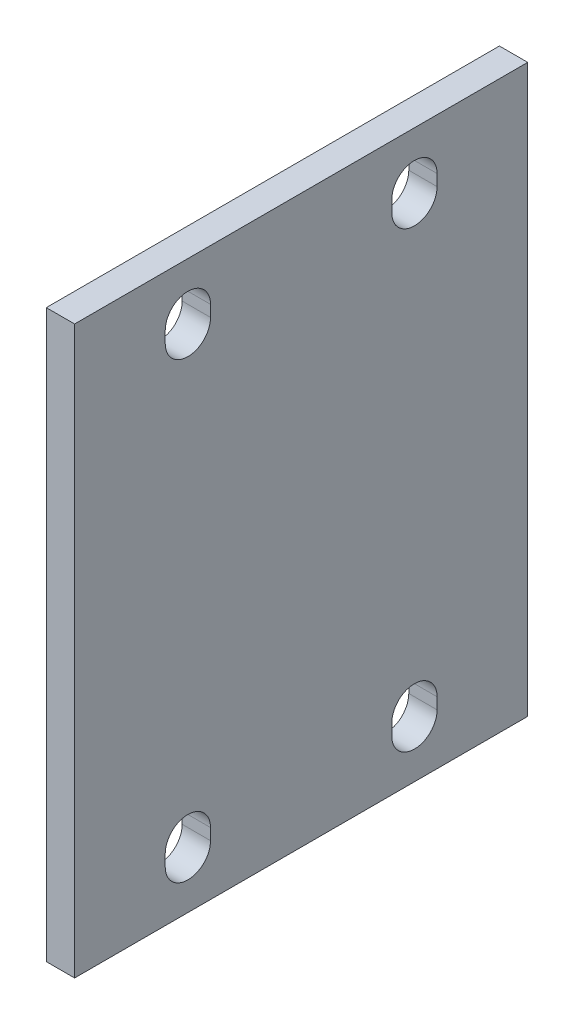
ISO-10303-21;
HEADER;
FILE_DESCRIPTION(('STEP AP214'),'2;1');
FILE_NAME('part.step','',(''),(''),'','','');
FILE_SCHEMA(('AUTOMOTIVE_DESIGN { 1 0 10303 214 1 1 1 1 }'));
ENDSEC;
DATA;
#1=APPLICATION_CONTEXT('core data for automotive mechanical design processes');
#2=APPLICATION_PROTOCOL_DEFINITION('international standard','automotive_design',2000,#1);
#3=PRODUCT_CONTEXT('',#1,'mechanical');
#4=PRODUCT('Part','Part','',(#3));
#5=PRODUCT_RELATED_PRODUCT_CATEGORY('part','',(#4));
#6=PRODUCT_DEFINITION_FORMATION('','',#4);
#7=PRODUCT_DEFINITION_CONTEXT('part definition',#1,'design');
#8=PRODUCT_DEFINITION('design','',#6,#7);
#9=PRODUCT_DEFINITION_SHAPE('','',#8);
#10=(LENGTH_UNIT() NAMED_UNIT(*) SI_UNIT(.MILLI.,.METRE.));
#11=(NAMED_UNIT(*) PLANE_ANGLE_UNIT() SI_UNIT($,.RADIAN.));
#12=(NAMED_UNIT(*) SI_UNIT($,.STERADIAN.) SOLID_ANGLE_UNIT());
#13=UNCERTAINTY_MEASURE_WITH_UNIT(LENGTH_MEASURE(1.E-05),#10,'distance_accuracy_value','');
#14=(GEOMETRIC_REPRESENTATION_CONTEXT(3) GLOBAL_UNCERTAINTY_ASSIGNED_CONTEXT((#13)) GLOBAL_UNIT_ASSIGNED_CONTEXT((#10,
#11,#12)) REPRESENTATION_CONTEXT('',''));
#15=CARTESIAN_POINT('',(0.,0.,0.));
#16=DIRECTION('',(0.,0.,1.));
#17=DIRECTION('',(1.,0.,0.));
#18=AXIS2_PLACEMENT_3D('',#15,#16,#17);
#19=CARTESIAN_POINT('',(5.,0.,24.));
#20=DIRECTION('',(0.,0.,1.));
#21=DIRECTION('',(1.,0.,0.));
#22=AXIS2_PLACEMENT_3D('',#19,#20,#21);
#23=PLANE('',#22);
#24=DIRECTION('',(0.,1.,0.));
#25=VECTOR('',#24,1.);
#26=CARTESIAN_POINT('',(0.,0.,24.));
#27=LINE('',#26,#25);
#28=CARTESIAN_POINT('',(0.,-41.,24.));
#29=VERTEX_POINT('',#28);
#30=CARTESIAN_POINT('',(0.,-39.,24.));
#31=VERTEX_POINT('',#30);
#32=EDGE_CURVE('E267',#29,#31,#27,.T.);
#33=ORIENTED_EDGE('',*,*,#32,.T.);
#34=DIRECTION('',(-1.,0.,0.));
#35=VECTOR('',#34,1.);
#36=CARTESIAN_POINT('',(5.,-39.,24.));
#37=LINE('',#36,#35);
#38=CARTESIAN_POINT('',(5.,-39.,24.));
#39=VERTEX_POINT('',#38);
#40=EDGE_CURVE('E11',#39,#31,#37,.T.);
#41=ORIENTED_EDGE('',*,*,#40,.F.);
#42=DIRECTION('',(0.,1.,0.));
#43=VECTOR('',#42,1.);
#44=CARTESIAN_POINT('',(5.,0.,24.));
#45=LINE('',#44,#43);
#46=CARTESIAN_POINT('',(5.,-41.,24.));
#47=VERTEX_POINT('',#46);
#48=EDGE_CURVE('E186',#47,#39,#45,.T.);
#49=ORIENTED_EDGE('',*,*,#48,.F.);
#50=DIRECTION('',(-1.,0.,0.));
#51=VECTOR('',#50,1.);
#52=CARTESIAN_POINT('',(5.,-41.,24.));
#53=LINE('',#52,#51);
#54=EDGE_CURVE('E279',#47,#29,#53,.T.);
#55=ORIENTED_EDGE('',*,*,#54,.T.);
#56=EDGE_LOOP('',(#33,#41,#49,#55));
#57=FACE_BOUND('',#56,.T.);
#58=ADVANCED_FACE('F41',(#57),#23,.F.);
#59=CARTESIAN_POINT('',(5.,-39.,20.));
#60=DIRECTION('',(-1.,0.,0.));
#61=DIRECTION('',(0.,0.,1.));
#62=AXIS2_PLACEMENT_3D('',#59,#60,#61);
#63=CYLINDRICAL_SURFACE('',#62,3.99999999999999);
#64=CARTESIAN_POINT('',(0.,-39.,20.));
#65=DIRECTION('',(1.,0.,0.));
#66=DIRECTION('',(0.,0.,-1.));
#67=AXIS2_PLACEMENT_3D('',#64,#65,#66);
#68=CIRCLE('',#67,3.99999999999999);
#69=CARTESIAN_POINT('',(0.,-39.,16.));
#70=VERTEX_POINT('',#69);
#71=EDGE_CURVE('E193',#31,#70,#68,.F.);
#72=ORIENTED_EDGE('',*,*,#71,.T.);
#73=DIRECTION('',(-1.,0.,0.));
#74=VECTOR('',#73,1.);
#75=CARTESIAN_POINT('',(5.,-39.,16.));
#76=LINE('',#75,#74);
#77=CARTESIAN_POINT('',(5.,-39.,16.));
#78=VERTEX_POINT('',#77);
#79=EDGE_CURVE('E52',#78,#70,#76,.T.);
#80=ORIENTED_EDGE('',*,*,#79,.F.);
#81=CARTESIAN_POINT('',(5.,-39.,20.));
#82=DIRECTION('',(1.,0.,0.));
#83=DIRECTION('',(0.,0.,-1.));
#84=AXIS2_PLACEMENT_3D('',#81,#82,#83);
#85=CIRCLE('',#84,3.99999999999999);
#86=EDGE_CURVE('E180',#39,#78,#85,.F.);
#87=ORIENTED_EDGE('',*,*,#86,.F.);
#88=ORIENTED_EDGE('',*,*,#40,.T.);
#89=EDGE_LOOP('',(#72,#80,#87,#88));
#90=FACE_BOUND('',#89,.T.);
#91=ADVANCED_FACE('F192',(#90),#63,.F.);
#92=CARTESIAN_POINT('',(5.,0.,16.));
#93=DIRECTION('',(0.,0.,1.));
#94=DIRECTION('',(1.,0.,0.));
#95=AXIS2_PLACEMENT_3D('',#92,#93,#94);
#96=PLANE('',#95);
#97=DIRECTION('',(0.,1.,0.));
#98=VECTOR('',#97,1.);
#99=CARTESIAN_POINT('',(0.,0.,16.));
#100=LINE('',#99,#98);
#101=CARTESIAN_POINT('',(0.,-41.,16.));
#102=VERTEX_POINT('',#101);
#103=EDGE_CURVE('E273',#102,#70,#100,.T.);
#104=ORIENTED_EDGE('',*,*,#103,.F.);
#105=DIRECTION('',(-1.,0.,0.));
#106=VECTOR('',#105,1.);
#107=CARTESIAN_POINT('',(5.,-41.,16.));
#108=LINE('',#107,#106);
#109=CARTESIAN_POINT('',(5.,-41.,16.));
#110=VERTEX_POINT('',#109);
#111=EDGE_CURVE('E123',#110,#102,#108,.T.);
#112=ORIENTED_EDGE('',*,*,#111,.F.);
#113=DIRECTION('',(0.,1.,0.));
#114=VECTOR('',#113,1.);
#115=CARTESIAN_POINT('',(5.,0.,16.));
#116=LINE('',#115,#114);
#117=EDGE_CURVE('E184',#110,#78,#116,.T.);
#118=ORIENTED_EDGE('',*,*,#117,.T.);
#119=ORIENTED_EDGE('',*,*,#79,.T.);
#120=EDGE_LOOP('',(#104,#112,#118,#119));
#121=FACE_BOUND('',#120,.T.);
#122=ADVANCED_FACE('F199',(#121),#96,.T.);
#123=CARTESIAN_POINT('',(5.,0.,-24.));
#124=DIRECTION('',(0.,0.,-1.));
#125=DIRECTION('',(-1.,0.,0.));
#126=AXIS2_PLACEMENT_3D('',#123,#124,#125);
#127=PLANE('',#126);
#128=DIRECTION('',(0.,-1.,0.));
#129=VECTOR('',#128,1.);
#130=CARTESIAN_POINT('',(0.,0.,-24.));
#131=LINE('',#130,#129);
#132=CARTESIAN_POINT('',(0.,41.,-24.));
#133=VERTEX_POINT('',#132);
#134=CARTESIAN_POINT('',(0.,39.,-24.));
#135=VERTEX_POINT('',#134);
#136=EDGE_CURVE('E252',#133,#135,#131,.T.);
#137=ORIENTED_EDGE('',*,*,#136,.T.);
#138=DIRECTION('',(-1.,0.,0.));
#139=VECTOR('',#138,1.);
#140=CARTESIAN_POINT('',(5.,39.,-24.));
#141=LINE('',#140,#139);
#142=CARTESIAN_POINT('',(5.,39.,-24.));
#143=VERTEX_POINT('',#142);
#144=EDGE_CURVE('E282',#143,#135,#141,.T.);
#145=ORIENTED_EDGE('',*,*,#144,.F.);
#146=DIRECTION('',(0.,-1.,0.));
#147=VECTOR('',#146,1.);
#148=CARTESIAN_POINT('',(5.,0.,-24.));
#149=LINE('',#148,#147);
#150=CARTESIAN_POINT('',(5.,41.,-24.));
#151=VERTEX_POINT('',#150);
#152=EDGE_CURVE('E388',#151,#143,#149,.T.);
#153=ORIENTED_EDGE('',*,*,#152,.F.);
#154=DIRECTION('',(-1.,0.,0.));
#155=VECTOR('',#154,1.);
#156=CARTESIAN_POINT('',(5.,41.,-24.));
#157=LINE('',#156,#155);
#158=EDGE_CURVE('E285',#151,#133,#157,.T.);
#159=ORIENTED_EDGE('',*,*,#158,.T.);
#160=EDGE_LOOP('',(#137,#145,#153,#159));
#161=FACE_BOUND('',#160,.T.);
#162=ADVANCED_FACE('F413',(#161),#127,.F.);
#163=CARTESIAN_POINT('',(5.,39.,-20.));
#164=DIRECTION('',(-1.,0.,0.));
#165=DIRECTION('',(0.,0.,1.));
#166=AXIS2_PLACEMENT_3D('',#163,#164,#165);
#167=CYLINDRICAL_SURFACE('',#166,3.99999999999998);
#168=CARTESIAN_POINT('',(0.,39.,-20.));
#169=DIRECTION('',(1.,0.,0.));
#170=DIRECTION('',(0.,0.,-1.));
#171=AXIS2_PLACEMENT_3D('',#168,#169,#170);
#172=CIRCLE('',#171,3.99999999999998);
#173=CARTESIAN_POINT('',(0.,39.,-16.));
#174=VERTEX_POINT('',#173);
#175=EDGE_CURVE('E256',#135,#174,#172,.F.);
#176=ORIENTED_EDGE('',*,*,#175,.T.);
#177=DIRECTION('',(-1.,0.,0.));
#178=VECTOR('',#177,1.);
#179=CARTESIAN_POINT('',(5.,39.,-16.));
#180=LINE('',#179,#178);
#181=CARTESIAN_POINT('',(5.,39.,-16.));
#182=VERTEX_POINT('',#181);
#183=EDGE_CURVE('E293',#182,#174,#180,.T.);
#184=ORIENTED_EDGE('',*,*,#183,.F.);
#185=CARTESIAN_POINT('',(5.,39.,-20.));
#186=DIRECTION('',(1.,0.,0.));
#187=DIRECTION('',(0.,0.,-1.));
#188=AXIS2_PLACEMENT_3D('',#185,#186,#187);
#189=CIRCLE('',#188,3.99999999999998);
#190=EDGE_CURVE('E392',#143,#182,#189,.F.);
#191=ORIENTED_EDGE('',*,*,#190,.F.);
#192=ORIENTED_EDGE('',*,*,#144,.T.);
#193=EDGE_LOOP('',(#176,#184,#191,#192));
#194=FACE_BOUND('',#193,.T.);
#195=ADVANCED_FACE('F415',(#194),#167,.F.);
#196=CARTESIAN_POINT('',(5.,0.,-16.));
#197=DIRECTION('',(0.,0.,-1.));
#198=DIRECTION('',(-1.,0.,0.));
#199=AXIS2_PLACEMENT_3D('',#196,#197,#198);
#200=PLANE('',#199);
#201=DIRECTION('',(0.,-1.,0.));
#202=VECTOR('',#201,1.);
#203=CARTESIAN_POINT('',(0.,0.,-16.));
#204=LINE('',#203,#202);
#205=CARTESIAN_POINT('',(0.,41.,-16.));
#206=VERTEX_POINT('',#205);
#207=EDGE_CURVE('E260',#206,#174,#204,.T.);
#208=ORIENTED_EDGE('',*,*,#207,.F.);
#209=DIRECTION('',(-1.,0.,0.));
#210=VECTOR('',#209,1.);
#211=CARTESIAN_POINT('',(5.,41.,-16.));
#212=LINE('',#211,#210);
#213=CARTESIAN_POINT('',(5.,41.,-16.));
#214=VERTEX_POINT('',#213);
#215=EDGE_CURVE('E289',#214,#206,#212,.T.);
#216=ORIENTED_EDGE('',*,*,#215,.F.);
#217=DIRECTION('',(0.,-1.,0.));
#218=VECTOR('',#217,1.);
#219=CARTESIAN_POINT('',(5.,0.,-16.));
#220=LINE('',#219,#218);
#221=EDGE_CURVE('E395',#214,#182,#220,.T.);
#222=ORIENTED_EDGE('',*,*,#221,.T.);
#223=ORIENTED_EDGE('',*,*,#183,.T.);
#224=EDGE_LOOP('',(#208,#216,#222,#223));
#225=FACE_BOUND('',#224,.T.);
#226=ADVANCED_FACE('F419',(#225),#200,.T.);
#227=CARTESIAN_POINT('',(5.,0.,-40.));
#228=DIRECTION('',(0.,0.,-1.));
#229=DIRECTION('',(-1.,0.,0.));
#230=AXIS2_PLACEMENT_3D('',#227,#228,#229);
#231=PLANE('',#230);
#232=DIRECTION('',(0.,-1.,0.));
#233=VECTOR('',#232,1.);
#234=CARTESIAN_POINT('',(0.,0.,-40.));
#235=LINE('',#234,#233);
#236=CARTESIAN_POINT('',(0.,50.,-40.));
#237=VERTEX_POINT('',#236);
#238=CARTESIAN_POINT('',(0.,-50.,-40.));
#239=VERTEX_POINT('',#238);
#240=EDGE_CURVE('E240',#237,#239,#235,.T.);
#241=ORIENTED_EDGE('',*,*,#240,.F.);
#242=DIRECTION('',(-1.,0.,0.));
#243=VECTOR('',#242,1.);
#244=CARTESIAN_POINT('',(5.,50.,-40.));
#245=LINE('',#244,#243);
#246=CARTESIAN_POINT('',(5.,50.,-40.));
#247=VERTEX_POINT('',#246);
#248=EDGE_CURVE('E290',#247,#237,#245,.T.);
#249=ORIENTED_EDGE('',*,*,#248,.F.);
#250=DIRECTION('',(0.,-1.,0.));
#251=VECTOR('',#250,1.);
#252=CARTESIAN_POINT('',(5.,0.,-40.));
#253=LINE('',#252,#251);
#254=CARTESIAN_POINT('',(5.,-50.,-40.));
#255=VERTEX_POINT('',#254);
#256=EDGE_CURVE('E376',#247,#255,#253,.T.);
#257=ORIENTED_EDGE('',*,*,#256,.T.);
#258=DIRECTION('',(-1.,0.,0.));
#259=VECTOR('',#258,1.);
#260=CARTESIAN_POINT('',(5.,-50.,-40.));
#261=LINE('',#260,#259);
#262=EDGE_CURVE('E299',#255,#239,#261,.T.);
#263=ORIENTED_EDGE('',*,*,#262,.T.);
#264=EDGE_LOOP('',(#241,#249,#257,#263));
#265=FACE_BOUND('',#264,.T.);
#266=ADVANCED_FACE('F447',(#265),#231,.T.);
#267=CARTESIAN_POINT('',(5.,50.,0.));
#268=DIRECTION('',(0.,1.,0.));
#269=DIRECTION('',(0.,0.,1.));
#270=AXIS2_PLACEMENT_3D('',#267,#268,#269);
#271=PLANE('',#270);
#272=DIRECTION('',(0.,0.,-1.));
#273=VECTOR('',#272,1.);
#274=CARTESIAN_POINT('',(0.,50.,0.));
#275=LINE('',#274,#273);
#276=CARTESIAN_POINT('',(0.,50.,40.));
#277=VERTEX_POINT('',#276);
#278=EDGE_CURVE('E244',#277,#237,#275,.T.);
#279=ORIENTED_EDGE('',*,*,#278,.F.);
#280=DIRECTION('',(-1.,0.,0.));
#281=VECTOR('',#280,1.);
#282=CARTESIAN_POINT('',(5.,50.,40.));
#283=LINE('',#282,#281);
#284=CARTESIAN_POINT('',(5.,50.,40.));
#285=VERTEX_POINT('',#284);
#286=EDGE_CURVE('E307',#285,#277,#283,.T.);
#287=ORIENTED_EDGE('',*,*,#286,.F.);
#288=DIRECTION('',(0.,0.,-1.));
#289=VECTOR('',#288,1.);
#290=CARTESIAN_POINT('',(5.,50.,0.));
#291=LINE('',#290,#289);
#292=EDGE_CURVE('E380',#285,#247,#291,.T.);
#293=ORIENTED_EDGE('',*,*,#292,.T.);
#294=ORIENTED_EDGE('',*,*,#248,.T.);
#295=EDGE_LOOP('',(#279,#287,#293,#294));
#296=FACE_BOUND('',#295,.T.);
#297=ADVANCED_FACE('F456',(#296),#271,.T.);
#298=CARTESIAN_POINT('',(5.,0.,40.));
#299=DIRECTION('',(0.,0.,-1.));
#300=DIRECTION('',(-1.,0.,0.));
#301=AXIS2_PLACEMENT_3D('',#298,#299,#300);
#302=PLANE('',#301);
#303=DIRECTION('',(0.,-1.,0.));
#304=VECTOR('',#303,1.);
#305=CARTESIAN_POINT('',(0.,0.,40.));
#306=LINE('',#305,#304);
#307=CARTESIAN_POINT('',(0.,-50.,40.));
#308=VERTEX_POINT('',#307);
#309=EDGE_CURVE('E248',#277,#308,#306,.T.);
#310=ORIENTED_EDGE('',*,*,#309,.T.);
#311=DIRECTION('',(-1.,0.,0.));
#312=VECTOR('',#311,1.);
#313=CARTESIAN_POINT('',(5.,-50.,40.));
#314=LINE('',#313,#312);
#315=CARTESIAN_POINT('',(5.,-50.,40.));
#316=VERTEX_POINT('',#315);
#317=EDGE_CURVE('E303',#316,#308,#314,.T.);
#318=ORIENTED_EDGE('',*,*,#317,.F.);
#319=DIRECTION('',(0.,-1.,0.));
#320=VECTOR('',#319,1.);
#321=CARTESIAN_POINT('',(5.,0.,40.));
#322=LINE('',#321,#320);
#323=EDGE_CURVE('E384',#285,#316,#322,.T.);
#324=ORIENTED_EDGE('',*,*,#323,.F.);
#325=ORIENTED_EDGE('',*,*,#286,.T.);
#326=EDGE_LOOP('',(#310,#318,#324,#325));
#327=FACE_BOUND('',#326,.T.);
#328=ADVANCED_FACE('F452',(#327),#302,.F.);
#329=CARTESIAN_POINT('',(5.,39.,20.));
#330=DIRECTION('',(-1.,0.,0.));
#331=DIRECTION('',(0.,0.,1.));
#332=AXIS2_PLACEMENT_3D('',#329,#330,#331);
#333=CYLINDRICAL_SURFACE('',#332,3.99999999999998);
#334=CARTESIAN_POINT('',(0.,39.,20.));
#335=DIRECTION('',(1.,0.,0.));
#336=DIRECTION('',(0.,0.,-1.));
#337=AXIS2_PLACEMENT_3D('',#334,#335,#336);
#338=CIRCLE('',#337,3.99999999999998);
#339=CARTESIAN_POINT('',(0.,39.,24.));
#340=VERTEX_POINT('',#339);
#341=CARTESIAN_POINT('',(0.,39.,16.));
#342=VERTEX_POINT('',#341);
#343=EDGE_CURVE('E224',#340,#342,#338,.T.);
#344=ORIENTED_EDGE('',*,*,#343,.F.);
#345=DIRECTION('',(-1.,0.,0.));
#346=VECTOR('',#345,1.);
#347=CARTESIAN_POINT('',(5.,39.,24.));
#348=LINE('',#347,#346);
#349=CARTESIAN_POINT('',(5.,39.,24.));
#350=VERTEX_POINT('',#349);
#351=EDGE_CURVE('E304',#350,#340,#348,.T.);
#352=ORIENTED_EDGE('',*,*,#351,.F.);
#353=CARTESIAN_POINT('',(5.,39.,20.));
#354=DIRECTION('',(1.,0.,0.));
#355=DIRECTION('',(0.,0.,-1.));
#356=AXIS2_PLACEMENT_3D('',#353,#354,#355);
#357=CIRCLE('',#356,3.99999999999998);
#358=CARTESIAN_POINT('',(5.,39.,16.));
#359=VERTEX_POINT('',#358);
#360=EDGE_CURVE('E353',#350,#359,#357,.T.);
#361=ORIENTED_EDGE('',*,*,#360,.T.);
#362=DIRECTION('',(-1.,0.,0.));
#363=VECTOR('',#362,1.);
#364=CARTESIAN_POINT('',(5.,39.,16.));
#365=LINE('',#364,#363);
#366=EDGE_CURVE('E312',#359,#342,#365,.T.);
#367=ORIENTED_EDGE('',*,*,#366,.T.);
#368=EDGE_LOOP('',(#344,#352,#361,#367));
#369=FACE_BOUND('',#368,.T.);
#370=ADVANCED_FACE('F455',(#369),#333,.F.);
#371=CARTESIAN_POINT('',(5.,0.,24.));
#372=DIRECTION('',(0.,0.,-1.));
#373=DIRECTION('',(-1.,0.,0.));
#374=AXIS2_PLACEMENT_3D('',#371,#372,#373);
#375=PLANE('',#374);
#376=DIRECTION('',(0.,-1.,0.));
#377=VECTOR('',#376,1.);
#378=CARTESIAN_POINT('',(0.,0.,24.));
#379=LINE('',#378,#377);
#380=CARTESIAN_POINT('',(0.,41.,24.));
#381=VERTEX_POINT('',#380);
#382=EDGE_CURVE('E228',#381,#340,#379,.T.);
#383=ORIENTED_EDGE('',*,*,#382,.F.);
#384=DIRECTION('',(-1.,0.,0.));
#385=VECTOR('',#384,1.);
#386=CARTESIAN_POINT('',(5.,41.,24.));
#387=LINE('',#386,#385);
#388=CARTESIAN_POINT('',(5.,41.,24.));
#389=VERTEX_POINT('',#388);
#390=EDGE_CURVE('E318',#389,#381,#387,.T.);
#391=ORIENTED_EDGE('',*,*,#390,.F.);
#392=DIRECTION('',(0.,-1.,0.));
#393=VECTOR('',#392,1.);
#394=CARTESIAN_POINT('',(5.,0.,24.));
#395=LINE('',#394,#393);
#396=EDGE_CURVE('E365',#389,#350,#395,.T.);
#397=ORIENTED_EDGE('',*,*,#396,.T.);
#398=ORIENTED_EDGE('',*,*,#351,.T.);
#399=EDGE_LOOP('',(#383,#391,#397,#398));
#400=FACE_BOUND('',#399,.T.);
#401=ADVANCED_FACE('F470',(#400),#375,.T.);
#402=CARTESIAN_POINT('',(5.,41.,20.));
#403=DIRECTION('',(-1.,0.,0.));
#404=DIRECTION('',(0.,0.,1.));
#405=AXIS2_PLACEMENT_3D('',#402,#403,#404);
#406=CYLINDRICAL_SURFACE('',#405,3.99999999999998);
#407=CARTESIAN_POINT('',(0.,41.,20.));
#408=DIRECTION('',(1.,0.,0.));
#409=DIRECTION('',(0.,0.,-1.));
#410=AXIS2_PLACEMENT_3D('',#407,#408,#409);
#411=CIRCLE('',#410,3.99999999999998);
#412=CARTESIAN_POINT('',(0.,41.,16.));
#413=VERTEX_POINT('',#412);
#414=EDGE_CURVE('E232',#413,#381,#411,.T.);
#415=ORIENTED_EDGE('',*,*,#414,.F.);
#416=DIRECTION('',(-1.,0.,0.));
#417=VECTOR('',#416,1.);
#418=CARTESIAN_POINT('',(5.,41.,16.));
#419=LINE('',#418,#417);
#420=CARTESIAN_POINT('',(5.,41.,16.));
#421=VERTEX_POINT('',#420);
#422=EDGE_CURVE('E315',#421,#413,#419,.T.);
#423=ORIENTED_EDGE('',*,*,#422,.F.);
#424=CARTESIAN_POINT('',(5.,41.,20.));
#425=DIRECTION('',(1.,0.,0.));
#426=DIRECTION('',(0.,0.,-1.));
#427=AXIS2_PLACEMENT_3D('',#424,#425,#426);
#428=CIRCLE('',#427,3.99999999999998);
#429=EDGE_CURVE('E369',#421,#389,#428,.T.);
#430=ORIENTED_EDGE('',*,*,#429,.T.);
#431=ORIENTED_EDGE('',*,*,#390,.T.);
#432=EDGE_LOOP('',(#415,#423,#430,#431));
#433=FACE_BOUND('',#432,.T.);
#434=ADVANCED_FACE('F467',(#433),#406,.F.);
#435=CARTESIAN_POINT('',(5.,-39.,-20.));
#436=DIRECTION('',(-1.,0.,0.));
#437=DIRECTION('',(0.,0.,1.));
#438=AXIS2_PLACEMENT_3D('',#435,#436,#437);
#439=CYLINDRICAL_SURFACE('',#438,3.99999999999999);
#440=CARTESIAN_POINT('',(0.,-39.,-20.));
#441=DIRECTION('',(1.,0.,0.));
#442=DIRECTION('',(0.,0.,-1.));
#443=AXIS2_PLACEMENT_3D('',#440,#441,#442);
#444=CIRCLE('',#443,3.99999999999999);
#445=CARTESIAN_POINT('',(0.,-39.,-24.));
#446=VERTEX_POINT('',#445);
#447=CARTESIAN_POINT('',(0.,-39.,-16.));
#448=VERTEX_POINT('',#447);
#449=EDGE_CURVE('E207',#446,#448,#444,.T.);
#450=ORIENTED_EDGE('',*,*,#449,.F.);
#451=DIRECTION('',(-1.,0.,0.));
#452=VECTOR('',#451,1.);
#453=CARTESIAN_POINT('',(5.,-39.,-24.));
#454=LINE('',#453,#452);
#455=CARTESIAN_POINT('',(5.,-39.,-24.));
#456=VERTEX_POINT('',#455);
#457=EDGE_CURVE('E45',#456,#446,#454,.T.);
#458=ORIENTED_EDGE('',*,*,#457,.F.);
#459=CARTESIAN_POINT('',(5.,-39.,-20.));
#460=DIRECTION('',(1.,0.,0.));
#461=DIRECTION('',(0.,0.,-1.));
#462=AXIS2_PLACEMENT_3D('',#459,#460,#461);
#463=CIRCLE('',#462,3.99999999999999);
#464=CARTESIAN_POINT('',(5.,-39.,-16.));
#465=VERTEX_POINT('',#464);
#466=EDGE_CURVE('E278',#456,#465,#463,.T.);
#467=ORIENTED_EDGE('',*,*,#466,.T.);
#468=DIRECTION('',(-1.,0.,0.));
#469=VECTOR('',#468,1.);
#470=CARTESIAN_POINT('',(5.,-39.,-16.));
#471=LINE('',#470,#469);
#472=EDGE_CURVE('E203',#465,#448,#471,.T.);
#473=ORIENTED_EDGE('',*,*,#472,.T.);
#474=EDGE_LOOP('',(#450,#458,#467,#473));
#475=FACE_BOUND('',#474,.T.);
#476=ADVANCED_FACE('F43',(#475),#439,.F.);
#477=CARTESIAN_POINT('',(5.,0.,-24.));
#478=DIRECTION('',(0.,0.,1.));
#479=DIRECTION('',(1.,0.,0.));
#480=AXIS2_PLACEMENT_3D('',#477,#478,#479);
#481=PLANE('',#480);
#482=DIRECTION('',(0.,1.,0.));
#483=VECTOR('',#482,1.);
#484=CARTESIAN_POINT('',(0.,0.,-24.));
#485=LINE('',#484,#483);
#486=CARTESIAN_POINT('',(0.,-41.,-24.));
#487=VERTEX_POINT('',#486);
#488=EDGE_CURVE('E211',#487,#446,#485,.T.);
#489=ORIENTED_EDGE('',*,*,#488,.F.);
#490=DIRECTION('',(-1.,0.,0.));
#491=VECTOR('',#490,1.);
#492=CARTESIAN_POINT('',(5.,-41.,-24.));
#493=LINE('',#492,#491);
#494=CARTESIAN_POINT('',(5.,-41.,-24.));
#495=VERTEX_POINT('',#494);
#496=EDGE_CURVE('E327',#495,#487,#493,.T.);
#497=ORIENTED_EDGE('',*,*,#496,.F.);
#498=DIRECTION('',(0.,1.,0.));
#499=VECTOR('',#498,1.);
#500=CARTESIAN_POINT('',(5.,0.,-24.));
#501=LINE('',#500,#499);
#502=EDGE_CURVE('E338',#495,#456,#501,.T.);
#503=ORIENTED_EDGE('',*,*,#502,.T.);
#504=ORIENTED_EDGE('',*,*,#457,.T.);
#505=EDGE_LOOP('',(#489,#497,#503,#504));
#506=FACE_BOUND('',#505,.T.);
#507=ADVANCED_FACE('F336',(#506),#481,.T.);
#508=CARTESIAN_POINT('',(5.,-41.,-20.));
#509=DIRECTION('',(-1.,0.,0.));
#510=DIRECTION('',(0.,0.,1.));
#511=AXIS2_PLACEMENT_3D('',#508,#509,#510);
#512=CYLINDRICAL_SURFACE('',#511,3.99999999999999);
#513=CARTESIAN_POINT('',(0.,-41.,-20.));
#514=DIRECTION('',(1.,0.,0.));
#515=DIRECTION('',(0.,0.,-1.));
#516=AXIS2_PLACEMENT_3D('',#513,#514,#515);
#517=CIRCLE('',#516,3.99999999999999);
#518=CARTESIAN_POINT('',(0.,-41.,-16.));
#519=VERTEX_POINT('',#518);
#520=EDGE_CURVE('E216',#519,#487,#517,.T.);
#521=ORIENTED_EDGE('',*,*,#520,.F.);
#522=DIRECTION('',(-1.,0.,0.));
#523=VECTOR('',#522,1.);
#524=CARTESIAN_POINT('',(5.,-41.,-16.));
#525=LINE('',#524,#523);
#526=CARTESIAN_POINT('',(5.,-41.,-16.));
#527=VERTEX_POINT('',#526);
#528=EDGE_CURVE('E325',#527,#519,#525,.T.);
#529=ORIENTED_EDGE('',*,*,#528,.F.);
#530=CARTESIAN_POINT('',(5.,-41.,-20.));
#531=DIRECTION('',(1.,0.,0.));
#532=DIRECTION('',(0.,0.,-1.));
#533=AXIS2_PLACEMENT_3D('',#530,#531,#532);
#534=CIRCLE('',#533,3.99999999999999);
#535=EDGE_CURVE('E347',#527,#495,#534,.T.);
#536=ORIENTED_EDGE('',*,*,#535,.T.);
#537=ORIENTED_EDGE('',*,*,#496,.T.);
#538=EDGE_LOOP('',(#521,#529,#536,#537));
#539=FACE_BOUND('',#538,.T.);
#540=ADVANCED_FACE('F344',(#539),#512,.F.);
#541=CARTESIAN_POINT('',(5.,-41.,20.));
#542=DIRECTION('',(-1.,0.,0.));
#543=DIRECTION('',(0.,0.,1.));
#544=AXIS2_PLACEMENT_3D('',#541,#542,#543);
#545=CYLINDRICAL_SURFACE('',#544,3.99999999999999);
#546=CARTESIAN_POINT('',(0.,-41.,20.));
#547=DIRECTION('',(1.,0.,0.));
#548=DIRECTION('',(0.,0.,-1.));
#549=AXIS2_PLACEMENT_3D('',#546,#547,#548);
#550=CIRCLE('',#549,3.99999999999999);
#551=EDGE_CURVE('E126',#102,#29,#550,.F.);
#552=ORIENTED_EDGE('',*,*,#551,.T.);
#553=ORIENTED_EDGE('',*,*,#54,.F.);
#554=CARTESIAN_POINT('',(5.,-41.,20.));
#555=DIRECTION('',(1.,0.,0.));
#556=DIRECTION('',(0.,0.,-1.));
#557=AXIS2_PLACEMENT_3D('',#554,#555,#556);
#558=CIRCLE('',#557,3.99999999999999);
#559=EDGE_CURVE('E61',#110,#47,#558,.F.);
#560=ORIENTED_EDGE('',*,*,#559,.F.);
#561=ORIENTED_EDGE('',*,*,#111,.T.);
#562=EDGE_LOOP('',(#552,#553,#560,#561));
#563=FACE_BOUND('',#562,.T.);
#564=ADVANCED_FACE('F427',(#563),#545,.F.);
#565=CARTESIAN_POINT('',(5.,41.,-20.));
#566=DIRECTION('',(-1.,0.,0.));
#567=DIRECTION('',(0.,0.,1.));
#568=AXIS2_PLACEMENT_3D('',#565,#566,#567);
#569=CYLINDRICAL_SURFACE('',#568,3.99999999999998);
#570=CARTESIAN_POINT('',(0.,41.,-20.));
#571=DIRECTION('',(1.,0.,0.));
#572=DIRECTION('',(0.,0.,-1.));
#573=AXIS2_PLACEMENT_3D('',#570,#571,#572);
#574=CIRCLE('',#573,3.99999999999998);
#575=EDGE_CURVE('E264',#206,#133,#574,.F.);
#576=ORIENTED_EDGE('',*,*,#575,.T.);
#577=ORIENTED_EDGE('',*,*,#158,.F.);
#578=CARTESIAN_POINT('',(5.,41.,-20.));
#579=DIRECTION('',(1.,0.,0.));
#580=DIRECTION('',(0.,0.,-1.));
#581=AXIS2_PLACEMENT_3D('',#578,#579,#580);
#582=CIRCLE('',#581,3.99999999999998);
#583=EDGE_CURVE('E399',#214,#151,#582,.F.);
#584=ORIENTED_EDGE('',*,*,#583,.F.);
#585=ORIENTED_EDGE('',*,*,#215,.T.);
#586=EDGE_LOOP('',(#576,#577,#584,#585));
#587=FACE_BOUND('',#586,.T.);
#588=ADVANCED_FACE('F409',(#587),#569,.F.);
#589=CARTESIAN_POINT('',(5.,0.,16.));
#590=DIRECTION('',(0.,0.,-1.));
#591=DIRECTION('',(-1.,0.,0.));
#592=AXIS2_PLACEMENT_3D('',#589,#590,#591);
#593=PLANE('',#592);
#594=DIRECTION('',(0.,-1.,0.));
#595=VECTOR('',#594,1.);
#596=CARTESIAN_POINT('',(0.,0.,16.));
#597=LINE('',#596,#595);
#598=EDGE_CURVE('E236',#413,#342,#597,.T.);
#599=ORIENTED_EDGE('',*,*,#598,.T.);
#600=ORIENTED_EDGE('',*,*,#366,.F.);
#601=DIRECTION('',(0.,-1.,0.));
#602=VECTOR('',#601,1.);
#603=CARTESIAN_POINT('',(5.,0.,16.));
#604=LINE('',#603,#602);
#605=EDGE_CURVE('E373',#421,#359,#604,.T.);
#606=ORIENTED_EDGE('',*,*,#605,.F.);
#607=ORIENTED_EDGE('',*,*,#422,.T.);
#608=EDGE_LOOP('',(#599,#600,#606,#607));
#609=FACE_BOUND('',#608,.T.);
#610=ADVANCED_FACE('F434',(#609),#593,.F.);
#611=CARTESIAN_POINT('',(5.,0.,-16.));
#612=DIRECTION('',(0.,0.,1.));
#613=DIRECTION('',(1.,0.,0.));
#614=AXIS2_PLACEMENT_3D('',#611,#612,#613);
#615=PLANE('',#614);
#616=DIRECTION('',(0.,1.,0.));
#617=VECTOR('',#616,1.);
#618=CARTESIAN_POINT('',(0.,0.,-16.));
#619=LINE('',#618,#617);
#620=EDGE_CURVE('E220',#519,#448,#619,.T.);
#621=ORIENTED_EDGE('',*,*,#620,.T.);
#622=ORIENTED_EDGE('',*,*,#472,.F.);
#623=DIRECTION('',(0.,1.,0.));
#624=VECTOR('',#623,1.);
#625=CARTESIAN_POINT('',(5.,0.,-16.));
#626=LINE('',#625,#624);
#627=EDGE_CURVE('E349',#527,#465,#626,.T.);
#628=ORIENTED_EDGE('',*,*,#627,.F.);
#629=ORIENTED_EDGE('',*,*,#528,.T.);
#630=EDGE_LOOP('',(#621,#622,#628,#629));
#631=FACE_BOUND('',#630,.T.);
#632=ADVANCED_FACE('F350',(#631),#615,.F.);
#633=CARTESIAN_POINT('',(5.,0.,0.));
#634=DIRECTION('',(1.,0.,0.));
#635=DIRECTION('',(0.,0.,-1.));
#636=AXIS2_PLACEMENT_3D('',#633,#634,#635);
#637=PLANE('',#636);
#638=DIRECTION('',(0.,0.,1.));
#639=VECTOR('',#638,1.);
#640=CARTESIAN_POINT('',(5.,-50.,40.));
#641=LINE('',#640,#639);
#642=EDGE_CURVE('E630',#255,#316,#641,.T.);
#643=ORIENTED_EDGE('',*,*,#642,.F.);
#644=ORIENTED_EDGE('',*,*,#256,.F.);
#645=ORIENTED_EDGE('',*,*,#292,.F.);
#646=ORIENTED_EDGE('',*,*,#323,.T.);
#647=EDGE_LOOP('',(#643,#644,#645,#646));
#648=FACE_BOUND('',#647,.T.);
#649=ORIENTED_EDGE('',*,*,#466,.F.);
#650=ORIENTED_EDGE('',*,*,#502,.F.);
#651=ORIENTED_EDGE('',*,*,#535,.F.);
#652=ORIENTED_EDGE('',*,*,#627,.T.);
#653=EDGE_LOOP('',(#649,#650,#651,#652));
#654=FACE_BOUND('',#653,.T.);
#655=ORIENTED_EDGE('',*,*,#360,.F.);
#656=ORIENTED_EDGE('',*,*,#396,.F.);
#657=ORIENTED_EDGE('',*,*,#429,.F.);
#658=ORIENTED_EDGE('',*,*,#605,.T.);
#659=EDGE_LOOP('',(#655,#656,#657,#658));
#660=FACE_BOUND('',#659,.T.);
#661=ORIENTED_EDGE('',*,*,#152,.T.);
#662=ORIENTED_EDGE('',*,*,#190,.T.);
#663=ORIENTED_EDGE('',*,*,#221,.F.);
#664=ORIENTED_EDGE('',*,*,#583,.T.);
#665=EDGE_LOOP('',(#661,#662,#663,#664));
#666=FACE_BOUND('',#665,.T.);
#667=ORIENTED_EDGE('',*,*,#48,.T.);
#668=ORIENTED_EDGE('',*,*,#86,.T.);
#669=ORIENTED_EDGE('',*,*,#117,.F.);
#670=ORIENTED_EDGE('',*,*,#559,.T.);
#671=EDGE_LOOP('',(#667,#668,#669,#670));
#672=FACE_BOUND('',#671,.T.);
#673=ADVANCED_FACE('F182',(#648,#654,#660,#666,#672),#637,.T.);
#674=CARTESIAN_POINT('',(0.,0.,0.));
#675=DIRECTION('',(1.,0.,0.));
#676=DIRECTION('',(0.,0.,-1.));
#677=AXIS2_PLACEMENT_3D('',#674,#675,#676);
#678=PLANE('',#677);
#679=ORIENTED_EDGE('',*,*,#449,.T.);
#680=ORIENTED_EDGE('',*,*,#620,.F.);
#681=ORIENTED_EDGE('',*,*,#520,.T.);
#682=ORIENTED_EDGE('',*,*,#488,.T.);
#683=EDGE_LOOP('',(#679,#680,#681,#682));
#684=FACE_BOUND('',#683,.T.);
#685=ORIENTED_EDGE('',*,*,#343,.T.);
#686=ORIENTED_EDGE('',*,*,#598,.F.);
#687=ORIENTED_EDGE('',*,*,#414,.T.);
#688=ORIENTED_EDGE('',*,*,#382,.T.);
#689=EDGE_LOOP('',(#685,#686,#687,#688));
#690=FACE_BOUND('',#689,.T.);
#691=ORIENTED_EDGE('',*,*,#240,.T.);
#692=DIRECTION('',(0.,0.,1.));
#693=VECTOR('',#692,1.);
#694=CARTESIAN_POINT('',(0.,-50.,40.));
#695=LINE('',#694,#693);
#696=EDGE_CURVE('E212',#239,#308,#695,.T.);
#697=ORIENTED_EDGE('',*,*,#696,.T.);
#698=ORIENTED_EDGE('',*,*,#309,.F.);
#699=ORIENTED_EDGE('',*,*,#278,.T.);
#700=EDGE_LOOP('',(#691,#697,#698,#699));
#701=FACE_BOUND('',#700,.T.);
#702=ORIENTED_EDGE('',*,*,#136,.F.);
#703=ORIENTED_EDGE('',*,*,#575,.F.);
#704=ORIENTED_EDGE('',*,*,#207,.T.);
#705=ORIENTED_EDGE('',*,*,#175,.F.);
#706=EDGE_LOOP('',(#702,#703,#704,#705));
#707=FACE_BOUND('',#706,.T.);
#708=ORIENTED_EDGE('',*,*,#32,.F.);
#709=ORIENTED_EDGE('',*,*,#551,.F.);
#710=ORIENTED_EDGE('',*,*,#103,.T.);
#711=ORIENTED_EDGE('',*,*,#71,.F.);
#712=EDGE_LOOP('',(#708,#709,#710,#711));
#713=FACE_BOUND('',#712,.T.);
#714=ADVANCED_FACE('F342',(#684,#690,#701,#707,#713),#678,.F.);
#715=CARTESIAN_POINT('',(0.,-50.,40.));
#716=DIRECTION('',(0.,1.,0.));
#717=DIRECTION('',(0.,0.,1.));
#718=AXIS2_PLACEMENT_3D('',#715,#716,#717);
#719=PLANE('',#718);
#720=ORIENTED_EDGE('',*,*,#642,.T.);
#721=ORIENTED_EDGE('',*,*,#317,.T.);
#722=ORIENTED_EDGE('',*,*,#696,.F.);
#723=ORIENTED_EDGE('',*,*,#262,.F.);
#724=EDGE_LOOP('',(#720,#721,#722,#723));
#725=FACE_BOUND('',#724,.T.);
#726=ADVANCED_FACE('F423',(#725),#719,.F.);
#727=CLOSED_SHELL('',(#58,#91,#122,#162,#195,#226,#266,#297,#328,#370,#401,#434,#476,#507,#540,
#564,#588,#610,#632,#673,#714,#726));
#728=MANIFOLD_SOLID_BREP('B2',#727);
#729=ADVANCED_BREP_SHAPE_REPRESENTATION('',(#18,#728),#14);
#730=SHAPE_DEFINITION_REPRESENTATION(#9,#729);
ENDSEC;
END-ISO-10303-21;
